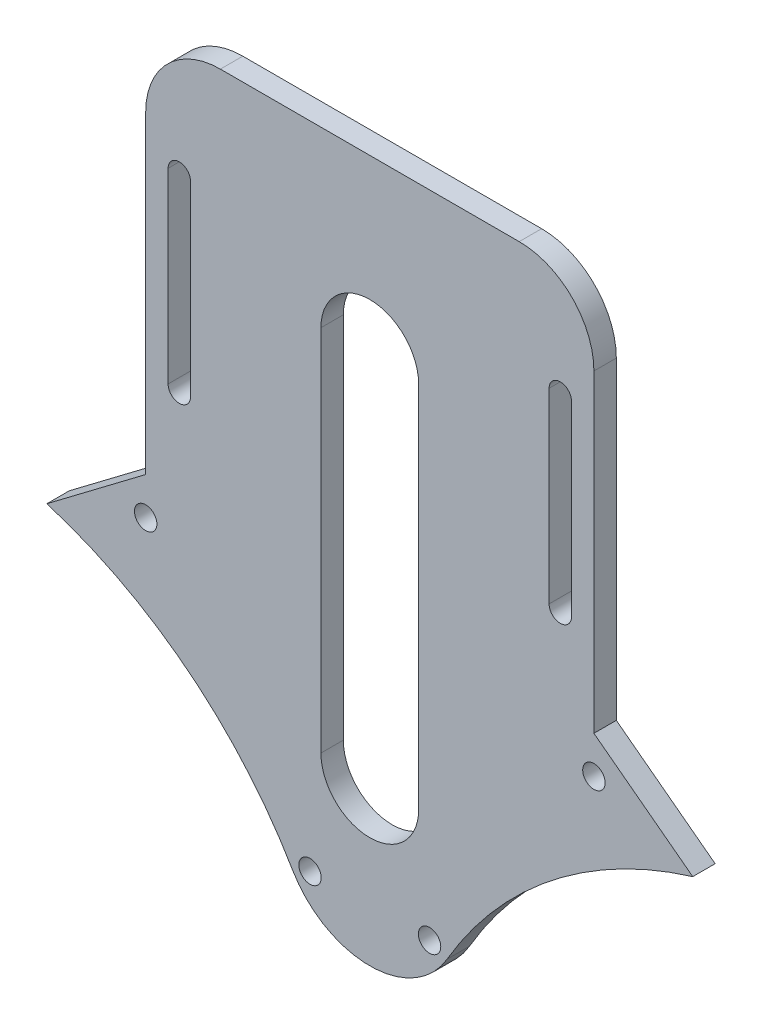
ISO-10303-21;
HEADER;
FILE_DESCRIPTION(('STEP AP214'),'2;1');
FILE_NAME('part.step','',(''),(''),'','','');
FILE_SCHEMA(('AUTOMOTIVE_DESIGN { 1 0 10303 214 1 1 1 1 }'));
ENDSEC;
DATA;
#1=APPLICATION_CONTEXT('core data for automotive mechanical design processes');
#2=APPLICATION_PROTOCOL_DEFINITION('international standard','automotive_design',2000,#1);
#3=PRODUCT_CONTEXT('',#1,'mechanical');
#4=PRODUCT('Part','Part','',(#3));
#5=PRODUCT_RELATED_PRODUCT_CATEGORY('part','',(#4));
#6=PRODUCT_DEFINITION_FORMATION('','',#4);
#7=PRODUCT_DEFINITION_CONTEXT('part definition',#1,'design');
#8=PRODUCT_DEFINITION('design','',#6,#7);
#9=PRODUCT_DEFINITION_SHAPE('','',#8);
#10=(LENGTH_UNIT() NAMED_UNIT(*) SI_UNIT(.MILLI.,.METRE.));
#11=(NAMED_UNIT(*) PLANE_ANGLE_UNIT() SI_UNIT($,.RADIAN.));
#12=(NAMED_UNIT(*) SI_UNIT($,.STERADIAN.) SOLID_ANGLE_UNIT());
#13=UNCERTAINTY_MEASURE_WITH_UNIT(LENGTH_MEASURE(1.E-05),#10,'distance_accuracy_value','');
#14=(GEOMETRIC_REPRESENTATION_CONTEXT(3) GLOBAL_UNCERTAINTY_ASSIGNED_CONTEXT((#13)) GLOBAL_UNIT_ASSIGNED_CONTEXT((#10,
#11,#12)) REPRESENTATION_CONTEXT('',''));
#15=CARTESIAN_POINT('',(0.,0.,0.));
#16=DIRECTION('',(0.,0.,1.));
#17=DIRECTION('',(1.,0.,0.));
#18=AXIS2_PLACEMENT_3D('',#15,#16,#17);
#19=CARTESIAN_POINT('',(-24.0000000000001,0.,3.));
#20=DIRECTION('',(1.,0.,0.));
#21=DIRECTION('',(0.,1.,0.));
#22=AXIS2_PLACEMENT_3D('',#19,#20,#21);
#23=PLANE('',#22);
#24=DIRECTION('',(0.,-1.,0.));
#25=VECTOR('',#24,1.);
#26=CARTESIAN_POINT('',(-24.0000000000001,0.,0.));
#27=LINE('',#26,#25);
#28=CARTESIAN_POINT('',(-23.9999999999998,102.,0.));
#29=VERTEX_POINT('',#28);
#30=CARTESIAN_POINT('',(-23.9999999999999,77.0000000000001,0.));
#31=VERTEX_POINT('',#30);
#32=EDGE_CURVE('E281',#29,#31,#27,.T.);
#33=ORIENTED_EDGE('',*,*,#32,.T.);
#34=DIRECTION('',(0.,0.,-1.));
#35=VECTOR('',#34,1.);
#36=CARTESIAN_POINT('',(-23.9999999999999,77.0000000000001,3.));
#37=LINE('',#36,#35);
#38=CARTESIAN_POINT('',(-23.9999999999999,77.0000000000001,3.));
#39=VERTEX_POINT('',#38);
#40=EDGE_CURVE('E11',#39,#31,#37,.T.);
#41=ORIENTED_EDGE('',*,*,#40,.F.);
#42=DIRECTION('',(0.,-1.,0.));
#43=VECTOR('',#42,1.);
#44=CARTESIAN_POINT('',(-24.0000000000001,0.,3.));
#45=LINE('',#44,#43);
#46=CARTESIAN_POINT('',(-23.9999999999998,102.,3.));
#47=VERTEX_POINT('',#46);
#48=EDGE_CURVE('E198',#47,#39,#45,.T.);
#49=ORIENTED_EDGE('',*,*,#48,.F.);
#50=DIRECTION('',(0.,0.,-1.));
#51=VECTOR('',#50,1.);
#52=CARTESIAN_POINT('',(-23.9999999999998,102.,3.));
#53=LINE('',#52,#51);
#54=EDGE_CURVE('E289',#47,#29,#53,.T.);
#55=ORIENTED_EDGE('',*,*,#54,.T.);
#56=EDGE_LOOP('',(#33,#41,#49,#55));
#57=FACE_BOUND('',#56,.T.);
#58=ADVANCED_FACE('F37',(#57),#23,.F.);
#59=CARTESIAN_POINT('',(-25.4999999999999,77.0000000000001,3.));
#60=DIRECTION('',(0.,0.,-1.));
#61=DIRECTION('',(-1.,0.,0.));
#62=AXIS2_PLACEMENT_3D('',#59,#60,#61);
#63=CYLINDRICAL_SURFACE('',#62,1.5);
#64=CARTESIAN_POINT('',(-25.4999999999999,77.0000000000001,0.));
#65=DIRECTION('',(0.,0.,1.));
#66=DIRECTION('',(1.,0.,0.));
#67=AXIS2_PLACEMENT_3D('',#64,#65,#66);
#68=CIRCLE('',#67,1.5);
#69=CARTESIAN_POINT('',(-26.9999999999999,77.0000000000001,0.));
#70=VERTEX_POINT('',#69);
#71=EDGE_CURVE('E204',#31,#70,#68,.F.);
#72=ORIENTED_EDGE('',*,*,#71,.T.);
#73=DIRECTION('',(0.,0.,-1.));
#74=VECTOR('',#73,1.);
#75=CARTESIAN_POINT('',(-26.9999999999999,77.0000000000001,3.));
#76=LINE('',#75,#74);
#77=CARTESIAN_POINT('',(-26.9999999999999,77.0000000000001,3.));
#78=VERTEX_POINT('',#77);
#79=EDGE_CURVE('E47',#78,#70,#76,.T.);
#80=ORIENTED_EDGE('',*,*,#79,.F.);
#81=CARTESIAN_POINT('',(-25.4999999999999,77.0000000000001,3.));
#82=DIRECTION('',(0.,0.,1.));
#83=DIRECTION('',(1.,0.,0.));
#84=AXIS2_PLACEMENT_3D('',#81,#82,#83);
#85=CIRCLE('',#84,1.5);
#86=EDGE_CURVE('E192',#39,#78,#85,.F.);
#87=ORIENTED_EDGE('',*,*,#86,.F.);
#88=ORIENTED_EDGE('',*,*,#40,.T.);
#89=EDGE_LOOP('',(#72,#80,#87,#88));
#90=FACE_BOUND('',#89,.T.);
#91=ADVANCED_FACE('F203',(#90),#63,.F.);
#92=CARTESIAN_POINT('',(-27.0000000000001,0.,3.));
#93=DIRECTION('',(1.,0.,0.));
#94=DIRECTION('',(0.,1.,0.));
#95=AXIS2_PLACEMENT_3D('',#92,#93,#94);
#96=PLANE('',#95);
#97=DIRECTION('',(0.,-1.,0.));
#98=VECTOR('',#97,1.);
#99=CARTESIAN_POINT('',(-27.0000000000001,0.,0.));
#100=LINE('',#99,#98);
#101=CARTESIAN_POINT('',(-26.9999999999998,102.,0.));
#102=VERTEX_POINT('',#101);
#103=EDGE_CURVE('E285',#102,#70,#100,.T.);
#104=ORIENTED_EDGE('',*,*,#103,.F.);
#105=DIRECTION('',(0.,0.,-1.));
#106=VECTOR('',#105,1.);
#107=CARTESIAN_POINT('',(-26.9999999999998,102.,3.));
#108=LINE('',#107,#106);
#109=CARTESIAN_POINT('',(-26.9999999999998,102.,3.));
#110=VERTEX_POINT('',#109);
#111=EDGE_CURVE('E126',#110,#102,#108,.T.);
#112=ORIENTED_EDGE('',*,*,#111,.F.);
#113=DIRECTION('',(0.,-1.,0.));
#114=VECTOR('',#113,1.);
#115=CARTESIAN_POINT('',(-27.0000000000001,0.,3.));
#116=LINE('',#115,#114);
#117=EDGE_CURVE('E196',#110,#78,#116,.T.);
#118=ORIENTED_EDGE('',*,*,#117,.T.);
#119=ORIENTED_EDGE('',*,*,#79,.T.);
#120=EDGE_LOOP('',(#104,#112,#118,#119));
#121=FACE_BOUND('',#120,.T.);
#122=ADVANCED_FACE('F209',(#121),#96,.T.);
#123=CARTESIAN_POINT('',(20.,107.,3.));
#124=DIRECTION('',(0.,0.,-1.));
#125=DIRECTION('',(-1.,0.,0.));
#126=AXIS2_PLACEMENT_3D('',#123,#124,#125);
#127=CYLINDRICAL_SURFACE('',#126,10.);
#128=CARTESIAN_POINT('',(20.,107.,0.));
#129=DIRECTION('',(0.,0.,1.));
#130=DIRECTION('',(1.,0.,0.));
#131=AXIS2_PLACEMENT_3D('',#128,#129,#130);
#132=CIRCLE('',#131,10.);
#133=CARTESIAN_POINT('',(19.9999999999999,117.,0.));
#134=VERTEX_POINT('',#133);
#135=CARTESIAN_POINT('',(30.,107.,0.));
#136=VERTEX_POINT('',#135);
#137=EDGE_CURVE('E251',#134,#136,#132,.F.);
#138=ORIENTED_EDGE('',*,*,#137,.F.);
#139=DIRECTION('',(0.,0.,-1.));
#140=VECTOR('',#139,1.);
#141=CARTESIAN_POINT('',(19.9999999999999,117.,3.));
#142=LINE('',#141,#140);
#143=CARTESIAN_POINT('',(19.9999999999999,117.,3.));
#144=VERTEX_POINT('',#143);
#145=EDGE_CURVE('E291',#144,#134,#142,.T.);
#146=ORIENTED_EDGE('',*,*,#145,.F.);
#147=CARTESIAN_POINT('',(20.,107.,3.));
#148=DIRECTION('',(0.,0.,1.));
#149=DIRECTION('',(1.,0.,0.));
#150=AXIS2_PLACEMENT_3D('',#147,#148,#149);
#151=CIRCLE('',#150,10.);
#152=CARTESIAN_POINT('',(30.,107.,3.));
#153=VERTEX_POINT('',#152);
#154=EDGE_CURVE('E367',#144,#153,#151,.F.);
#155=ORIENTED_EDGE('',*,*,#154,.T.);
#156=DIRECTION('',(0.,0.,-1.));
#157=VECTOR('',#156,1.);
#158=CARTESIAN_POINT('',(30.,107.,3.));
#159=LINE('',#158,#157);
#160=EDGE_CURVE('E293',#153,#136,#159,.T.);
#161=ORIENTED_EDGE('',*,*,#160,.T.);
#162=EDGE_LOOP('',(#138,#146,#155,#161));
#163=FACE_BOUND('',#162,.T.);
#164=ADVANCED_FACE('F404',(#163),#127,.T.);
#165=CARTESIAN_POINT('',(0.,117.,3.));
#166=DIRECTION('',(0.,-1.,0.));
#167=DIRECTION('',(0.,0.,-1.));
#168=AXIS2_PLACEMENT_3D('',#165,#166,#167);
#169=PLANE('',#168);
#170=DIRECTION('',(-1.,0.,0.));
#171=VECTOR('',#170,1.);
#172=CARTESIAN_POINT('',(0.,117.,0.));
#173=LINE('',#172,#171);
#174=CARTESIAN_POINT('',(-19.9999999999999,117.,0.));
#175=VERTEX_POINT('',#174);
#176=EDGE_CURVE('E254',#134,#175,#173,.T.);
#177=ORIENTED_EDGE('',*,*,#176,.T.);
#178=DIRECTION('',(0.,0.,-1.));
#179=VECTOR('',#178,1.);
#180=CARTESIAN_POINT('',(-19.9999999999999,117.,3.));
#181=LINE('',#180,#179);
#182=CARTESIAN_POINT('',(-19.9999999999999,117.,3.));
#183=VERTEX_POINT('',#182);
#184=EDGE_CURVE('E313',#183,#175,#181,.T.);
#185=ORIENTED_EDGE('',*,*,#184,.F.);
#186=DIRECTION('',(-1.,0.,0.));
#187=VECTOR('',#186,1.);
#188=CARTESIAN_POINT('',(0.,117.,3.));
#189=LINE('',#188,#187);
#190=EDGE_CURVE('E370',#144,#183,#189,.T.);
#191=ORIENTED_EDGE('',*,*,#190,.F.);
#192=ORIENTED_EDGE('',*,*,#145,.T.);
#193=EDGE_LOOP('',(#177,#185,#191,#192));
#194=FACE_BOUND('',#193,.T.);
#195=ADVANCED_FACE('F409',(#194),#169,.F.);
#196=CARTESIAN_POINT('',(-20.,107.,3.));
#197=DIRECTION('',(0.,0.,-1.));
#198=DIRECTION('',(-1.,0.,0.));
#199=AXIS2_PLACEMENT_3D('',#196,#197,#198);
#200=CYLINDRICAL_SURFACE('',#199,10.);
#201=CARTESIAN_POINT('',(-20.,107.,0.));
#202=DIRECTION('',(0.,0.,1.));
#203=DIRECTION('',(1.,0.,0.));
#204=AXIS2_PLACEMENT_3D('',#201,#202,#203);
#205=CIRCLE('',#204,10.);
#206=CARTESIAN_POINT('',(-30.,107.,0.));
#207=VERTEX_POINT('',#206);
#208=EDGE_CURVE('E257',#207,#175,#205,.F.);
#209=ORIENTED_EDGE('',*,*,#208,.F.);
#210=DIRECTION('',(0.,0.,-1.));
#211=VECTOR('',#210,1.);
#212=CARTESIAN_POINT('',(-30.,107.,3.));
#213=LINE('',#212,#211);
#214=CARTESIAN_POINT('',(-30.,107.,3.));
#215=VERTEX_POINT('',#214);
#216=EDGE_CURVE('E311',#215,#207,#213,.T.);
#217=ORIENTED_EDGE('',*,*,#216,.F.);
#218=CARTESIAN_POINT('',(-20.,107.,3.));
#219=DIRECTION('',(0.,0.,1.));
#220=DIRECTION('',(1.,0.,0.));
#221=AXIS2_PLACEMENT_3D('',#218,#219,#220);
#222=CIRCLE('',#221,10.);
#223=EDGE_CURVE('E372',#215,#183,#222,.F.);
#224=ORIENTED_EDGE('',*,*,#223,.T.);
#225=ORIENTED_EDGE('',*,*,#184,.T.);
#226=EDGE_LOOP('',(#209,#217,#224,#225));
#227=FACE_BOUND('',#226,.T.);
#228=ADVANCED_FACE('F415',(#227),#200,.T.);
#229=CARTESIAN_POINT('',(-30.,0.,3.));
#230=DIRECTION('',(1.,0.,0.));
#231=DIRECTION('',(0.,1.,0.));
#232=AXIS2_PLACEMENT_3D('',#229,#230,#231);
#233=PLANE('',#232);
#234=DIRECTION('',(0.,-1.,0.));
#235=VECTOR('',#234,1.);
#236=CARTESIAN_POINT('',(-30.,0.,0.));
#237=LINE('',#236,#235);
#238=CARTESIAN_POINT('',(-30.,65.,0.));
#239=VERTEX_POINT('',#238);
#240=EDGE_CURVE('E260',#207,#239,#237,.T.);
#241=ORIENTED_EDGE('',*,*,#240,.T.);
#242=DIRECTION('',(0.,0.,-1.));
#243=VECTOR('',#242,1.);
#244=CARTESIAN_POINT('',(-30.,65.,3.));
#245=LINE('',#244,#243);
#246=CARTESIAN_POINT('',(-30.,65.,3.));
#247=VERTEX_POINT('',#246);
#248=EDGE_CURVE('E308',#247,#239,#245,.T.);
#249=ORIENTED_EDGE('',*,*,#248,.F.);
#250=DIRECTION('',(0.,-1.,0.));
#251=VECTOR('',#250,1.);
#252=CARTESIAN_POINT('',(-30.,0.,3.));
#253=LINE('',#252,#251);
#254=EDGE_CURVE('E375',#215,#247,#253,.T.);
#255=ORIENTED_EDGE('',*,*,#254,.F.);
#256=ORIENTED_EDGE('',*,*,#216,.T.);
#257=EDGE_LOOP('',(#241,#249,#255,#256));
#258=FACE_BOUND('',#257,.T.);
#259=ADVANCED_FACE('F418',(#258),#233,.F.);
#260=CARTESIAN_POINT('',(-42.1758180792113,55.796457063803,3.));
#261=DIRECTION('',(0.603001408925935,-0.797740121112971,0.));
#262=DIRECTION('',(0.797740121112971,0.603001408925935,0.));
#263=AXIS2_PLACEMENT_3D('',#260,#261,#262);
#264=PLANE('',#263);
#265=DIRECTION('',(-0.797740121112971,-0.603001408925935,0.));
#266=VECTOR('',#265,1.);
#267=CARTESIAN_POINT('',(-42.1758180792113,55.796457063803,0.));
#268=LINE('',#267,#266);
#269=CARTESIAN_POINT('',(-43.2294901687526,55.0000000000001,0.));
#270=VERTEX_POINT('',#269);
#271=EDGE_CURVE('E263',#239,#270,#268,.T.);
#272=ORIENTED_EDGE('',*,*,#271,.T.);
#273=DIRECTION('',(0.,0.,-1.));
#274=VECTOR('',#273,1.);
#275=CARTESIAN_POINT('',(-43.2294901687526,55.0000000000001,3.));
#276=LINE('',#275,#274);
#277=CARTESIAN_POINT('',(-43.2294901687526,55.0000000000001,3.));
#278=VERTEX_POINT('',#277);
#279=EDGE_CURVE('E305',#278,#270,#276,.T.);
#280=ORIENTED_EDGE('',*,*,#279,.F.);
#281=DIRECTION('',(-0.797740121112971,-0.603001408925935,0.));
#282=VECTOR('',#281,1.);
#283=CARTESIAN_POINT('',(-42.1758180792113,55.796457063803,3.));
#284=LINE('',#283,#282);
#285=EDGE_CURVE('E378',#247,#278,#284,.T.);
#286=ORIENTED_EDGE('',*,*,#285,.F.);
#287=ORIENTED_EDGE('',*,*,#248,.T.);
#288=EDGE_LOOP('',(#272,#280,#286,#287));
#289=FACE_BOUND('',#288,.T.);
#290=ADVANCED_FACE('F420',(#289),#264,.F.);
#291=CARTESIAN_POINT('',(-60.,-2.38152510246026E-13,3.));
#292=DIRECTION('',(0.,0.,-1.));
#293=DIRECTION('',(-1.,0.,0.));
#294=AXIS2_PLACEMENT_3D('',#291,#292,#293);
#295=CYLINDRICAL_SURFACE('',#294,57.5000000000001);
#296=CARTESIAN_POINT('',(-60.,-2.38152510246026E-13,0.));
#297=DIRECTION('',(0.,0.,1.));
#298=DIRECTION('',(1.,0.,0.));
#299=AXIS2_PLACEMENT_3D('',#296,#297,#298);
#300=CIRCLE('',#299,57.5000000000001);
#301=CARTESIAN_POINT('',(-10.3327131983401,28.972583967635,0.));
#302=VERTEX_POINT('',#301);
#303=EDGE_CURVE('E266',#270,#302,#300,.F.);
#304=ORIENTED_EDGE('',*,*,#303,.T.);
#305=DIRECTION('',(0.,0.,-1.));
#306=VECTOR('',#305,1.);
#307=CARTESIAN_POINT('',(-10.3327131983401,28.972583967635,3.));
#308=LINE('',#307,#306);
#309=CARTESIAN_POINT('',(-10.3327131983401,28.972583967635,3.));
#310=VERTEX_POINT('',#309);
#311=EDGE_CURVE('E302',#310,#302,#308,.T.);
#312=ORIENTED_EDGE('',*,*,#311,.F.);
#313=CARTESIAN_POINT('',(-60.,-2.38152510246026E-13,3.));
#314=DIRECTION('',(0.,0.,1.));
#315=DIRECTION('',(1.,0.,0.));
#316=AXIS2_PLACEMENT_3D('',#313,#314,#315);
#317=CIRCLE('',#316,57.5000000000001);
#318=EDGE_CURVE('E381',#278,#310,#317,.F.);
#319=ORIENTED_EDGE('',*,*,#318,.F.);
#320=ORIENTED_EDGE('',*,*,#279,.T.);
#321=EDGE_LOOP('',(#304,#312,#319,#320));
#322=FACE_BOUND('',#321,.T.);
#323=ADVANCED_FACE('F425',(#322),#295,.F.);
#324=CARTESIAN_POINT('',(0.,35.,3.));
#325=DIRECTION('',(0.,0.,-1.));
#326=DIRECTION('',(-1.,0.,0.));
#327=AXIS2_PLACEMENT_3D('',#324,#325,#326);
#328=CYLINDRICAL_SURFACE('',#327,11.962219947249);
#329=CARTESIAN_POINT('',(0.,35.,0.));
#330=DIRECTION('',(0.,0.,1.));
#331=DIRECTION('',(1.,0.,0.));
#332=AXIS2_PLACEMENT_3D('',#329,#330,#331);
#333=CIRCLE('',#332,11.962219947249);
#334=CARTESIAN_POINT('',(10.33271319834,28.9725839676349,0.));
#335=VERTEX_POINT('',#334);
#336=EDGE_CURVE('E269',#302,#335,#333,.T.);
#337=ORIENTED_EDGE('',*,*,#336,.T.);
#338=DIRECTION('',(0.,0.,-1.));
#339=VECTOR('',#338,1.);
#340=CARTESIAN_POINT('',(10.33271319834,28.9725839676349,3.));
#341=LINE('',#340,#339);
#342=CARTESIAN_POINT('',(10.33271319834,28.9725839676349,3.));
#343=VERTEX_POINT('',#342);
#344=EDGE_CURVE('E300',#343,#335,#341,.T.);
#345=ORIENTED_EDGE('',*,*,#344,.F.);
#346=CARTESIAN_POINT('',(0.,35.,3.));
#347=DIRECTION('',(0.,0.,1.));
#348=DIRECTION('',(1.,0.,0.));
#349=AXIS2_PLACEMENT_3D('',#346,#347,#348);
#350=CIRCLE('',#349,11.962219947249);
#351=EDGE_CURVE('E384',#310,#343,#350,.T.);
#352=ORIENTED_EDGE('',*,*,#351,.F.);
#353=ORIENTED_EDGE('',*,*,#311,.T.);
#354=EDGE_LOOP('',(#337,#345,#352,#353));
#355=FACE_BOUND('',#354,.T.);
#356=ADVANCED_FACE('F427',(#355),#328,.T.);
#357=CARTESIAN_POINT('',(59.9999999999998,-4.18563751747614E-13,3.));
#358=DIRECTION('',(0.,0.,-1.));
#359=DIRECTION('',(-1.,0.,0.));
#360=AXIS2_PLACEMENT_3D('',#357,#358,#359);
#361=CYLINDRICAL_SURFACE('',#360,57.5000000000001);
#362=CARTESIAN_POINT('',(59.9999999999998,-4.18563751747614E-13,0.));
#363=DIRECTION('',(0.,0.,1.));
#364=DIRECTION('',(1.,0.,0.));
#365=AXIS2_PLACEMENT_3D('',#362,#363,#364);
#366=CIRCLE('',#365,57.5000000000001);
#367=CARTESIAN_POINT('',(43.2294901687526,55.,0.));
#368=VERTEX_POINT('',#367);
#369=EDGE_CURVE('E272',#368,#335,#366,.T.);
#370=ORIENTED_EDGE('',*,*,#369,.F.);
#371=DIRECTION('',(0.,0.,-1.));
#372=VECTOR('',#371,1.);
#373=CARTESIAN_POINT('',(43.2294901687526,55.,3.));
#374=LINE('',#373,#372);
#375=CARTESIAN_POINT('',(43.2294901687526,55.,3.));
#376=VERTEX_POINT('',#375);
#377=EDGE_CURVE('E298',#376,#368,#374,.T.);
#378=ORIENTED_EDGE('',*,*,#377,.F.);
#379=CARTESIAN_POINT('',(59.9999999999998,-4.18563751747614E-13,3.));
#380=DIRECTION('',(0.,0.,1.));
#381=DIRECTION('',(1.,0.,0.));
#382=AXIS2_PLACEMENT_3D('',#379,#380,#381);
#383=CIRCLE('',#382,57.5000000000001);
#384=EDGE_CURVE('E386',#376,#343,#383,.T.);
#385=ORIENTED_EDGE('',*,*,#384,.T.);
#386=ORIENTED_EDGE('',*,*,#344,.T.);
#387=EDGE_LOOP('',(#370,#378,#385,#386));
#388=FACE_BOUND('',#387,.T.);
#389=ADVANCED_FACE('F430',(#388),#361,.F.);
#390=CARTESIAN_POINT('',(42.1758180792115,55.7964570638027,3.));
#391=DIRECTION('',(0.603001408925939,0.797740121112968,0.));
#392=DIRECTION('',(-0.797740121112968,0.603001408925939,0.));
#393=AXIS2_PLACEMENT_3D('',#390,#391,#392);
#394=PLANE('',#393);
#395=DIRECTION('',(0.797740121112968,-0.603001408925939,0.));
#396=VECTOR('',#395,1.);
#397=CARTESIAN_POINT('',(42.1758180792115,55.7964570638027,0.));
#398=LINE('',#397,#396);
#399=CARTESIAN_POINT('',(30.,65.,0.));
#400=VERTEX_POINT('',#399);
#401=EDGE_CURVE('E275',#400,#368,#398,.T.);
#402=ORIENTED_EDGE('',*,*,#401,.F.);
#403=DIRECTION('',(0.,0.,-1.));
#404=VECTOR('',#403,1.);
#405=CARTESIAN_POINT('',(30.,65.,3.));
#406=LINE('',#405,#404);
#407=CARTESIAN_POINT('',(30.,65.,3.));
#408=VERTEX_POINT('',#407);
#409=EDGE_CURVE('E295',#408,#400,#406,.T.);
#410=ORIENTED_EDGE('',*,*,#409,.F.);
#411=DIRECTION('',(0.797740121112968,-0.603001408925939,0.));
#412=VECTOR('',#411,1.);
#413=CARTESIAN_POINT('',(42.1758180792115,55.7964570638027,3.));
#414=LINE('',#413,#412);
#415=EDGE_CURVE('E389',#408,#376,#414,.T.);
#416=ORIENTED_EDGE('',*,*,#415,.T.);
#417=ORIENTED_EDGE('',*,*,#377,.T.);
#418=EDGE_LOOP('',(#402,#410,#416,#417));
#419=FACE_BOUND('',#418,.T.);
#420=ADVANCED_FACE('F433',(#419),#394,.T.);
#421=CARTESIAN_POINT('',(25.5,77.,3.));
#422=DIRECTION('',(0.,0.,-1.));
#423=DIRECTION('',(-1.,0.,0.));
#424=AXIS2_PLACEMENT_3D('',#421,#422,#423);
#425=CYLINDRICAL_SURFACE('',#424,1.5);
#426=CARTESIAN_POINT('',(25.5,77.,0.));
#427=DIRECTION('',(0.,0.,1.));
#428=DIRECTION('',(1.,0.,0.));
#429=AXIS2_PLACEMENT_3D('',#426,#427,#428);
#430=CIRCLE('',#429,1.5);
#431=CARTESIAN_POINT('',(24.,77.,0.));
#432=VERTEX_POINT('',#431);
#433=CARTESIAN_POINT('',(27.,77.,0.));
#434=VERTEX_POINT('',#433);
#435=EDGE_CURVE('E239',#432,#434,#430,.T.);
#436=ORIENTED_EDGE('',*,*,#435,.F.);
#437=DIRECTION('',(0.,0.,-1.));
#438=VECTOR('',#437,1.);
#439=CARTESIAN_POINT('',(24.,77.,3.));
#440=LINE('',#439,#438);
#441=CARTESIAN_POINT('',(24.,77.,3.));
#442=VERTEX_POINT('',#441);
#443=EDGE_CURVE('E296',#442,#432,#440,.T.);
#444=ORIENTED_EDGE('',*,*,#443,.F.);
#445=CARTESIAN_POINT('',(25.5,77.,3.));
#446=DIRECTION('',(0.,0.,1.));
#447=DIRECTION('',(1.,0.,0.));
#448=AXIS2_PLACEMENT_3D('',#445,#446,#447);
#449=CIRCLE('',#448,1.5);
#450=CARTESIAN_POINT('',(27.,77.,3.));
#451=VERTEX_POINT('',#450);
#452=EDGE_CURVE('E349',#442,#451,#449,.T.);
#453=ORIENTED_EDGE('',*,*,#452,.T.);
#454=DIRECTION('',(0.,0.,-1.));
#455=VECTOR('',#454,1.);
#456=CARTESIAN_POINT('',(27.,77.,3.));
#457=LINE('',#456,#455);
#458=EDGE_CURVE('E316',#451,#434,#457,.T.);
#459=ORIENTED_EDGE('',*,*,#458,.T.);
#460=EDGE_LOOP('',(#436,#444,#453,#459));
#461=FACE_BOUND('',#460,.T.);
#462=ADVANCED_FACE('F465',(#461),#425,.F.);
#463=CARTESIAN_POINT('',(24.,0.,3.));
#464=DIRECTION('',(1.,0.,0.));
#465=DIRECTION('',(0.,1.,0.));
#466=AXIS2_PLACEMENT_3D('',#463,#464,#465);
#467=PLANE('',#466);
#468=DIRECTION('',(0.,-1.,0.));
#469=VECTOR('',#468,1.);
#470=CARTESIAN_POINT('',(24.,0.,0.));
#471=LINE('',#470,#469);
#472=CARTESIAN_POINT('',(24.,102.,0.));
#473=VERTEX_POINT('',#472);
#474=EDGE_CURVE('E242',#473,#432,#471,.T.);
#475=ORIENTED_EDGE('',*,*,#474,.F.);
#476=DIRECTION('',(0.,0.,-1.));
#477=VECTOR('',#476,1.);
#478=CARTESIAN_POINT('',(24.,102.,3.));
#479=LINE('',#478,#477);
#480=CARTESIAN_POINT('',(24.,102.,3.));
#481=VERTEX_POINT('',#480);
#482=EDGE_CURVE('E320',#481,#473,#479,.T.);
#483=ORIENTED_EDGE('',*,*,#482,.F.);
#484=DIRECTION('',(0.,-1.,0.));
#485=VECTOR('',#484,1.);
#486=CARTESIAN_POINT('',(24.,0.,3.));
#487=LINE('',#486,#485);
#488=EDGE_CURVE('E359',#481,#442,#487,.T.);
#489=ORIENTED_EDGE('',*,*,#488,.T.);
#490=ORIENTED_EDGE('',*,*,#443,.T.);
#491=EDGE_LOOP('',(#475,#483,#489,#490));
#492=FACE_BOUND('',#491,.T.);
#493=ADVANCED_FACE('F488',(#492),#467,.T.);
#494=CARTESIAN_POINT('',(25.5,102.,3.));
#495=DIRECTION('',(0.,0.,-1.));
#496=DIRECTION('',(-1.,0.,0.));
#497=AXIS2_PLACEMENT_3D('',#494,#495,#496);
#498=CYLINDRICAL_SURFACE('',#497,1.5);
#499=CARTESIAN_POINT('',(25.5,102.,0.));
#500=DIRECTION('',(0.,0.,1.));
#501=DIRECTION('',(1.,0.,0.));
#502=AXIS2_PLACEMENT_3D('',#499,#500,#501);
#503=CIRCLE('',#502,1.5);
#504=CARTESIAN_POINT('',(27.,102.,0.));
#505=VERTEX_POINT('',#504);
#506=EDGE_CURVE('E245',#505,#473,#503,.T.);
#507=ORIENTED_EDGE('',*,*,#506,.F.);
#508=DIRECTION('',(0.,0.,-1.));
#509=VECTOR('',#508,1.);
#510=CARTESIAN_POINT('',(27.,102.,3.));
#511=LINE('',#510,#509);
#512=CARTESIAN_POINT('',(27.,102.,3.));
#513=VERTEX_POINT('',#512);
#514=EDGE_CURVE('E318',#513,#505,#511,.T.);
#515=ORIENTED_EDGE('',*,*,#514,.F.);
#516=CARTESIAN_POINT('',(25.5,102.,3.));
#517=DIRECTION('',(0.,0.,1.));
#518=DIRECTION('',(1.,0.,0.));
#519=AXIS2_PLACEMENT_3D('',#516,#517,#518);
#520=CIRCLE('',#519,1.5);
#521=EDGE_CURVE('E362',#513,#481,#520,.T.);
#522=ORIENTED_EDGE('',*,*,#521,.T.);
#523=ORIENTED_EDGE('',*,*,#482,.T.);
#524=EDGE_LOOP('',(#507,#515,#522,#523));
#525=FACE_BOUND('',#524,.T.);
#526=ADVANCED_FACE('F485',(#525),#498,.F.);
#527=CARTESIAN_POINT('',(0.,93.7489491860057,3.));
#528=DIRECTION('',(0.,0.,-1.));
#529=DIRECTION('',(-1.,0.,0.));
#530=AXIS2_PLACEMENT_3D('',#527,#528,#529);
#531=CYLINDRICAL_SURFACE('',#530,6.54179371023542);
#532=CARTESIAN_POINT('',(0.,93.7489491860057,0.));
#533=DIRECTION('',(0.,0.,1.));
#534=DIRECTION('',(1.,0.,0.));
#535=AXIS2_PLACEMENT_3D('',#532,#533,#534);
#536=CIRCLE('',#535,6.54179371023542);
#537=CARTESIAN_POINT('',(6.54179371023542,93.7489491860057,0.));
#538=VERTEX_POINT('',#537);
#539=CARTESIAN_POINT('',(-6.54179371023542,93.7489491860057,0.));
#540=VERTEX_POINT('',#539);
#541=EDGE_CURVE('E227',#538,#540,#536,.T.);
#542=ORIENTED_EDGE('',*,*,#541,.F.);
#543=DIRECTION('',(0.,0.,-1.));
#544=VECTOR('',#543,1.);
#545=CARTESIAN_POINT('',(6.54179371023542,93.7489491860057,3.));
#546=LINE('',#545,#544);
#547=CARTESIAN_POINT('',(6.54179371023542,93.7489491860057,3.));
#548=VERTEX_POINT('',#547);
#549=EDGE_CURVE('E41',#548,#538,#546,.T.);
#550=ORIENTED_EDGE('',*,*,#549,.F.);
#551=CARTESIAN_POINT('',(0.,93.7489491860057,3.));
#552=DIRECTION('',(0.,0.,1.));
#553=DIRECTION('',(1.,0.,0.));
#554=AXIS2_PLACEMENT_3D('',#551,#552,#553);
#555=CIRCLE('',#554,6.54179371023542);
#556=CARTESIAN_POINT('',(-6.54179371023542,93.7489491860057,3.));
#557=VERTEX_POINT('',#556);
#558=EDGE_CURVE('E353',#548,#557,#555,.T.);
#559=ORIENTED_EDGE('',*,*,#558,.T.);
#560=DIRECTION('',(0.,0.,-1.));
#561=VECTOR('',#560,1.);
#562=CARTESIAN_POINT('',(-6.54179371023542,93.7489491860057,3.));
#563=LINE('',#562,#561);
#564=EDGE_CURVE('E211',#557,#540,#563,.T.);
#565=ORIENTED_EDGE('',*,*,#564,.T.);
#566=EDGE_LOOP('',(#542,#550,#559,#565));
#567=FACE_BOUND('',#566,.T.);
#568=ADVANCED_FACE('F335',(#567),#531,.F.);
#569=CARTESIAN_POINT('',(6.54179371023542,0.,3.));
#570=DIRECTION('',(-1.,0.,0.));
#571=DIRECTION('',(0.,0.,1.));
#572=AXIS2_PLACEMENT_3D('',#569,#570,#571);
#573=PLANE('',#572);
#574=DIRECTION('',(0.,1.,0.));
#575=VECTOR('',#574,1.);
#576=CARTESIAN_POINT('',(6.54179371023542,0.,0.));
#577=LINE('',#576,#575);
#578=CARTESIAN_POINT('',(6.54179371023542,44.4384306270993,0.));
#579=VERTEX_POINT('',#578);
#580=EDGE_CURVE('E230',#579,#538,#577,.T.);
#581=ORIENTED_EDGE('',*,*,#580,.F.);
#582=DIRECTION('',(0.,0.,-1.));
#583=VECTOR('',#582,1.);
#584=CARTESIAN_POINT('',(6.54179371023542,44.4384306270993,3.));
#585=LINE('',#584,#583);
#586=CARTESIAN_POINT('',(6.54179371023542,44.4384306270993,3.));
#587=VERTEX_POINT('',#586);
#588=EDGE_CURVE('E325',#587,#579,#585,.T.);
#589=ORIENTED_EDGE('',*,*,#588,.F.);
#590=DIRECTION('',(0.,1.,0.));
#591=VECTOR('',#590,1.);
#592=CARTESIAN_POINT('',(6.54179371023542,0.,3.));
#593=LINE('',#592,#591);
#594=EDGE_CURVE('E334',#587,#548,#593,.T.);
#595=ORIENTED_EDGE('',*,*,#594,.T.);
#596=ORIENTED_EDGE('',*,*,#549,.T.);
#597=EDGE_LOOP('',(#581,#589,#595,#596));
#598=FACE_BOUND('',#597,.T.);
#599=ADVANCED_FACE('F332',(#598),#573,.T.);
#600=CARTESIAN_POINT('',(0.,44.4384306270993,3.));
#601=DIRECTION('',(0.,0.,-1.));
#602=DIRECTION('',(-1.,0.,0.));
#603=AXIS2_PLACEMENT_3D('',#600,#601,#602);
#604=CYLINDRICAL_SURFACE('',#603,6.54179371023542);
#605=CARTESIAN_POINT('',(0.,44.4384306270993,0.));
#606=DIRECTION('',(0.,0.,1.));
#607=DIRECTION('',(1.,0.,0.));
#608=AXIS2_PLACEMENT_3D('',#605,#606,#607);
#609=CIRCLE('',#608,6.54179371023542);
#610=CARTESIAN_POINT('',(-6.54179371023542,44.4384306270993,0.));
#611=VERTEX_POINT('',#610);
#612=EDGE_CURVE('E233',#611,#579,#609,.T.);
#613=ORIENTED_EDGE('',*,*,#612,.F.);
#614=DIRECTION('',(0.,0.,-1.));
#615=VECTOR('',#614,1.);
#616=CARTESIAN_POINT('',(-6.54179371023542,44.4384306270993,3.));
#617=LINE('',#616,#615);
#618=CARTESIAN_POINT('',(-6.54179371023542,44.4384306270993,3.));
#619=VERTEX_POINT('',#618);
#620=EDGE_CURVE('E324',#619,#611,#617,.T.);
#621=ORIENTED_EDGE('',*,*,#620,.F.);
#622=CARTESIAN_POINT('',(0.,44.4384306270993,3.));
#623=DIRECTION('',(0.,0.,1.));
#624=DIRECTION('',(1.,0.,0.));
#625=AXIS2_PLACEMENT_3D('',#622,#623,#624);
#626=CIRCLE('',#625,6.54179371023542);
#627=EDGE_CURVE('E344',#619,#587,#626,.T.);
#628=ORIENTED_EDGE('',*,*,#627,.T.);
#629=ORIENTED_EDGE('',*,*,#588,.T.);
#630=EDGE_LOOP('',(#613,#621,#628,#629));
#631=FACE_BOUND('',#630,.T.);
#632=ADVANCED_FACE('F341',(#631),#604,.F.);
#633=CARTESIAN_POINT('',(30.,0.,3.));
#634=DIRECTION('',(-1.,0.,0.));
#635=DIRECTION('',(0.,-1.,0.));
#636=AXIS2_PLACEMENT_3D('',#633,#634,#635);
#637=PLANE('',#636);
#638=DIRECTION('',(0.,1.,0.));
#639=VECTOR('',#638,1.);
#640=CARTESIAN_POINT('',(30.,0.,0.));
#641=LINE('',#640,#639);
#642=EDGE_CURVE('E278',#400,#136,#641,.T.);
#643=ORIENTED_EDGE('',*,*,#642,.T.);
#644=ORIENTED_EDGE('',*,*,#160,.F.);
#645=DIRECTION('',(0.,1.,0.));
#646=VECTOR('',#645,1.);
#647=CARTESIAN_POINT('',(30.,0.,3.));
#648=LINE('',#647,#646);
#649=EDGE_CURVE('E392',#408,#153,#648,.T.);
#650=ORIENTED_EDGE('',*,*,#649,.F.);
#651=ORIENTED_EDGE('',*,*,#409,.T.);
#652=EDGE_LOOP('',(#643,#644,#650,#651));
#653=FACE_BOUND('',#652,.T.);
#654=ADVANCED_FACE('F400',(#653),#637,.F.);
#655=CARTESIAN_POINT('',(27.,0.,3.));
#656=DIRECTION('',(1.,0.,0.));
#657=DIRECTION('',(0.,0.,-1.));
#658=AXIS2_PLACEMENT_3D('',#655,#656,#657);
#659=PLANE('',#658);
#660=DIRECTION('',(0.,-1.,0.));
#661=VECTOR('',#660,1.);
#662=CARTESIAN_POINT('',(27.,0.,0.));
#663=LINE('',#662,#661);
#664=EDGE_CURVE('E248',#505,#434,#663,.T.);
#665=ORIENTED_EDGE('',*,*,#664,.T.);
#666=ORIENTED_EDGE('',*,*,#458,.F.);
#667=DIRECTION('',(0.,-1.,0.));
#668=VECTOR('',#667,1.);
#669=CARTESIAN_POINT('',(27.,0.,3.));
#670=LINE('',#669,#668);
#671=EDGE_CURVE('E365',#513,#451,#670,.T.);
#672=ORIENTED_EDGE('',*,*,#671,.F.);
#673=ORIENTED_EDGE('',*,*,#514,.T.);
#674=EDGE_LOOP('',(#665,#666,#672,#673));
#675=FACE_BOUND('',#674,.T.);
#676=ADVANCED_FACE('F462',(#675),#659,.F.);
#677=CARTESIAN_POINT('',(-6.54179371023542,0.,3.));
#678=DIRECTION('',(-1.,0.,0.));
#679=DIRECTION('',(0.,0.,1.));
#680=AXIS2_PLACEMENT_3D('',#677,#678,#679);
#681=PLANE('',#680);
#682=DIRECTION('',(0.,1.,0.));
#683=VECTOR('',#682,1.);
#684=CARTESIAN_POINT('',(-6.54179371023542,0.,0.));
#685=LINE('',#684,#683);
#686=EDGE_CURVE('E236',#611,#540,#685,.T.);
#687=ORIENTED_EDGE('',*,*,#686,.T.);
#688=ORIENTED_EDGE('',*,*,#564,.F.);
#689=DIRECTION('',(0.,1.,0.));
#690=VECTOR('',#689,1.);
#691=CARTESIAN_POINT('',(-6.54179371023542,0.,3.));
#692=LINE('',#691,#690);
#693=EDGE_CURVE('E346',#619,#557,#692,.T.);
#694=ORIENTED_EDGE('',*,*,#693,.F.);
#695=ORIENTED_EDGE('',*,*,#620,.T.);
#696=EDGE_LOOP('',(#687,#688,#694,#695));
#697=FACE_BOUND('',#696,.T.);
#698=ADVANCED_FACE('F347',(#697),#681,.F.);
#699=CARTESIAN_POINT('',(-30.,60.,3.));
#700=DIRECTION('',(0.,0.,-1.));
#701=DIRECTION('',(-1.,0.,0.));
#702=AXIS2_PLACEMENT_3D('',#699,#700,#701);
#703=CYLINDRICAL_SURFACE('',#702,1.5);
#704=CARTESIAN_POINT('',(-30.,60.,3.));
#705=DIRECTION('',(0.,0.,1.));
#706=DIRECTION('',(1.,0.,0.));
#707=AXIS2_PLACEMENT_3D('',#704,#705,#706);
#708=CIRCLE('',#707,1.5);
#709=CARTESIAN_POINT('',(-28.5,60.,3.));
#710=VERTEX_POINT('',#709);
#711=EDGE_CURVE('E531',#710,#710,#708,.T.);
#712=ORIENTED_EDGE('',*,*,#711,.T.);
#713=EDGE_LOOP('',(#712));
#714=FACE_BOUND('',#713,.T.);
#715=CARTESIAN_POINT('',(-30.,60.,0.));
#716=DIRECTION('',(0.,0.,1.));
#717=DIRECTION('',(1.,0.,0.));
#718=AXIS2_PLACEMENT_3D('',#715,#716,#717);
#719=CIRCLE('',#718,1.5);
#720=CARTESIAN_POINT('',(-28.5,60.,0.));
#721=VERTEX_POINT('',#720);
#722=EDGE_CURVE('E224',#721,#721,#719,.T.);
#723=ORIENTED_EDGE('',*,*,#722,.F.);
#724=EDGE_LOOP('',(#723));
#725=FACE_BOUND('',#724,.T.);
#726=ADVANCED_FACE('F498',(#714,#725),#703,.F.);
#727=CARTESIAN_POINT('',(-8.00000000000001,30.,3.));
#728=DIRECTION('',(0.,0.,-1.));
#729=DIRECTION('',(-1.,0.,0.));
#730=AXIS2_PLACEMENT_3D('',#727,#728,#729);
#731=CYLINDRICAL_SURFACE('',#730,1.5);
#732=CARTESIAN_POINT('',(-8.00000000000001,30.,3.));
#733=DIRECTION('',(0.,0.,1.));
#734=DIRECTION('',(1.,0.,0.));
#735=AXIS2_PLACEMENT_3D('',#732,#733,#734);
#736=CIRCLE('',#735,1.5);
#737=CARTESIAN_POINT('',(-6.50000000000001,30.,3.));
#738=VERTEX_POINT('',#737);
#739=EDGE_CURVE('E528',#738,#738,#736,.T.);
#740=ORIENTED_EDGE('',*,*,#739,.T.);
#741=EDGE_LOOP('',(#740));
#742=FACE_BOUND('',#741,.T.);
#743=CARTESIAN_POINT('',(-8.00000000000001,30.,0.));
#744=DIRECTION('',(0.,0.,1.));
#745=DIRECTION('',(1.,0.,0.));
#746=AXIS2_PLACEMENT_3D('',#743,#744,#745);
#747=CIRCLE('',#746,1.5);
#748=CARTESIAN_POINT('',(-6.50000000000001,30.,0.));
#749=VERTEX_POINT('',#748);
#750=EDGE_CURVE('E221',#749,#749,#747,.T.);
#751=ORIENTED_EDGE('',*,*,#750,.F.);
#752=EDGE_LOOP('',(#751));
#753=FACE_BOUND('',#752,.T.);
#754=ADVANCED_FACE('F507',(#742,#753),#731,.F.);
#755=CARTESIAN_POINT('',(7.99999999999999,30.,3.));
#756=DIRECTION('',(0.,0.,-1.));
#757=DIRECTION('',(-1.,0.,0.));
#758=AXIS2_PLACEMENT_3D('',#755,#756,#757);
#759=CYLINDRICAL_SURFACE('',#758,1.5);
#760=CARTESIAN_POINT('',(7.99999999999999,30.,3.));
#761=DIRECTION('',(0.,0.,1.));
#762=DIRECTION('',(1.,0.,0.));
#763=AXIS2_PLACEMENT_3D('',#760,#761,#762);
#764=CIRCLE('',#763,1.5);
#765=CARTESIAN_POINT('',(9.49999999999999,30.,3.));
#766=VERTEX_POINT('',#765);
#767=EDGE_CURVE('E518',#766,#766,#764,.T.);
#768=ORIENTED_EDGE('',*,*,#767,.T.);
#769=EDGE_LOOP('',(#768));
#770=FACE_BOUND('',#769,.T.);
#771=CARTESIAN_POINT('',(7.99999999999999,30.,0.));
#772=DIRECTION('',(0.,0.,1.));
#773=DIRECTION('',(1.,0.,0.));
#774=AXIS2_PLACEMENT_3D('',#771,#772,#773);
#775=CIRCLE('',#774,1.5);
#776=CARTESIAN_POINT('',(9.49999999999999,30.,0.));
#777=VERTEX_POINT('',#776);
#778=EDGE_CURVE('E218',#777,#777,#775,.T.);
#779=ORIENTED_EDGE('',*,*,#778,.F.);
#780=EDGE_LOOP('',(#779));
#781=FACE_BOUND('',#780,.T.);
#782=ADVANCED_FACE('F450',(#770,#781),#759,.F.);
#783=CARTESIAN_POINT('',(30.,60.,3.));
#784=DIRECTION('',(0.,0.,-1.));
#785=DIRECTION('',(-1.,0.,0.));
#786=AXIS2_PLACEMENT_3D('',#783,#784,#785);
#787=CYLINDRICAL_SURFACE('',#786,1.5);
#788=CARTESIAN_POINT('',(30.,60.,3.));
#789=DIRECTION('',(0.,0.,1.));
#790=DIRECTION('',(1.,0.,0.));
#791=AXIS2_PLACEMENT_3D('',#788,#789,#790);
#792=CIRCLE('',#791,1.5);
#793=CARTESIAN_POINT('',(31.5,60.,3.));
#794=VERTEX_POINT('',#793);
#795=EDGE_CURVE('E288',#794,#794,#792,.T.);
#796=ORIENTED_EDGE('',*,*,#795,.T.);
#797=EDGE_LOOP('',(#796));
#798=FACE_BOUND('',#797,.T.);
#799=CARTESIAN_POINT('',(30.,60.,0.));
#800=DIRECTION('',(0.,0.,1.));
#801=DIRECTION('',(1.,0.,0.));
#802=AXIS2_PLACEMENT_3D('',#799,#800,#801);
#803=CIRCLE('',#802,1.5);
#804=CARTESIAN_POINT('',(31.5,60.,0.));
#805=VERTEX_POINT('',#804);
#806=EDGE_CURVE('E215',#805,#805,#803,.T.);
#807=ORIENTED_EDGE('',*,*,#806,.F.);
#808=EDGE_LOOP('',(#807));
#809=FACE_BOUND('',#808,.T.);
#810=ADVANCED_FACE('F39',(#798,#809),#787,.F.);
#811=CARTESIAN_POINT('',(-25.4999999999998,102.,3.));
#812=DIRECTION('',(0.,0.,-1.));
#813=DIRECTION('',(-1.,0.,0.));
#814=AXIS2_PLACEMENT_3D('',#811,#812,#813);
#815=CYLINDRICAL_SURFACE('',#814,1.5);
#816=CARTESIAN_POINT('',(-25.4999999999998,102.,0.));
#817=DIRECTION('',(0.,0.,1.));
#818=DIRECTION('',(1.,0.,0.));
#819=AXIS2_PLACEMENT_3D('',#816,#817,#818);
#820=CIRCLE('',#819,1.5);
#821=EDGE_CURVE('E129',#102,#29,#820,.F.);
#822=ORIENTED_EDGE('',*,*,#821,.T.);
#823=ORIENTED_EDGE('',*,*,#54,.F.);
#824=CARTESIAN_POINT('',(-25.4999999999998,102.,3.));
#825=DIRECTION('',(0.,0.,1.));
#826=DIRECTION('',(1.,0.,0.));
#827=AXIS2_PLACEMENT_3D('',#824,#825,#826);
#828=CIRCLE('',#827,1.5);
#829=EDGE_CURVE('E56',#110,#47,#828,.F.);
#830=ORIENTED_EDGE('',*,*,#829,.F.);
#831=ORIENTED_EDGE('',*,*,#111,.T.);
#832=EDGE_LOOP('',(#822,#823,#830,#831));
#833=FACE_BOUND('',#832,.T.);
#834=ADVANCED_FACE('F441',(#833),#815,.F.);
#835=CARTESIAN_POINT('',(0.,0.,3.));
#836=DIRECTION('',(0.,0.,1.));
#837=DIRECTION('',(1.,0.,0.));
#838=AXIS2_PLACEMENT_3D('',#835,#836,#837);
#839=PLANE('',#838);
#840=ORIENTED_EDGE('',*,*,#795,.F.);
#841=EDGE_LOOP('',(#840));
#842=FACE_BOUND('',#841,.T.);
#843=ORIENTED_EDGE('',*,*,#767,.F.);
#844=EDGE_LOOP('',(#843));
#845=FACE_BOUND('',#844,.T.);
#846=ORIENTED_EDGE('',*,*,#739,.F.);
#847=EDGE_LOOP('',(#846));
#848=FACE_BOUND('',#847,.T.);
#849=ORIENTED_EDGE('',*,*,#711,.F.);
#850=EDGE_LOOP('',(#849));
#851=FACE_BOUND('',#850,.T.);
#852=ORIENTED_EDGE('',*,*,#558,.F.);
#853=ORIENTED_EDGE('',*,*,#594,.F.);
#854=ORIENTED_EDGE('',*,*,#627,.F.);
#855=ORIENTED_EDGE('',*,*,#693,.T.);
#856=EDGE_LOOP('',(#852,#853,#854,#855));
#857=FACE_BOUND('',#856,.T.);
#858=ORIENTED_EDGE('',*,*,#452,.F.);
#859=ORIENTED_EDGE('',*,*,#488,.F.);
#860=ORIENTED_EDGE('',*,*,#521,.F.);
#861=ORIENTED_EDGE('',*,*,#671,.T.);
#862=EDGE_LOOP('',(#858,#859,#860,#861));
#863=FACE_BOUND('',#862,.T.);
#864=ORIENTED_EDGE('',*,*,#154,.F.);
#865=ORIENTED_EDGE('',*,*,#190,.T.);
#866=ORIENTED_EDGE('',*,*,#223,.F.);
#867=ORIENTED_EDGE('',*,*,#254,.T.);
#868=ORIENTED_EDGE('',*,*,#285,.T.);
#869=ORIENTED_EDGE('',*,*,#318,.T.);
#870=ORIENTED_EDGE('',*,*,#351,.T.);
#871=ORIENTED_EDGE('',*,*,#384,.F.);
#872=ORIENTED_EDGE('',*,*,#415,.F.);
#873=ORIENTED_EDGE('',*,*,#649,.T.);
#874=EDGE_LOOP('',(#864,#865,#866,#867,#868,#869,#870,#871,#872,#873));
#875=FACE_BOUND('',#874,.T.);
#876=ORIENTED_EDGE('',*,*,#48,.T.);
#877=ORIENTED_EDGE('',*,*,#86,.T.);
#878=ORIENTED_EDGE('',*,*,#117,.F.);
#879=ORIENTED_EDGE('',*,*,#829,.T.);
#880=EDGE_LOOP('',(#876,#877,#878,#879));
#881=FACE_BOUND('',#880,.T.);
#882=ADVANCED_FACE('F194',(#842,#845,#848,#851,#857,#863,#875,#881),#839,.T.);
#883=CARTESIAN_POINT('',(0.,0.,0.));
#884=DIRECTION('',(0.,0.,1.));
#885=DIRECTION('',(1.,0.,0.));
#886=AXIS2_PLACEMENT_3D('',#883,#884,#885);
#887=PLANE('',#886);
#888=ORIENTED_EDGE('',*,*,#806,.T.);
#889=EDGE_LOOP('',(#888));
#890=FACE_BOUND('',#889,.T.);
#891=ORIENTED_EDGE('',*,*,#778,.T.);
#892=EDGE_LOOP('',(#891));
#893=FACE_BOUND('',#892,.T.);
#894=ORIENTED_EDGE('',*,*,#750,.T.);
#895=EDGE_LOOP('',(#894));
#896=FACE_BOUND('',#895,.T.);
#897=ORIENTED_EDGE('',*,*,#722,.T.);
#898=EDGE_LOOP('',(#897));
#899=FACE_BOUND('',#898,.T.);
#900=ORIENTED_EDGE('',*,*,#541,.T.);
#901=ORIENTED_EDGE('',*,*,#686,.F.);
#902=ORIENTED_EDGE('',*,*,#612,.T.);
#903=ORIENTED_EDGE('',*,*,#580,.T.);
#904=EDGE_LOOP('',(#900,#901,#902,#903));
#905=FACE_BOUND('',#904,.T.);
#906=ORIENTED_EDGE('',*,*,#435,.T.);
#907=ORIENTED_EDGE('',*,*,#664,.F.);
#908=ORIENTED_EDGE('',*,*,#506,.T.);
#909=ORIENTED_EDGE('',*,*,#474,.T.);
#910=EDGE_LOOP('',(#906,#907,#908,#909));
#911=FACE_BOUND('',#910,.T.);
#912=ORIENTED_EDGE('',*,*,#137,.T.);
#913=ORIENTED_EDGE('',*,*,#642,.F.);
#914=ORIENTED_EDGE('',*,*,#401,.T.);
#915=ORIENTED_EDGE('',*,*,#369,.T.);
#916=ORIENTED_EDGE('',*,*,#336,.F.);
#917=ORIENTED_EDGE('',*,*,#303,.F.);
#918=ORIENTED_EDGE('',*,*,#271,.F.);
#919=ORIENTED_EDGE('',*,*,#240,.F.);
#920=ORIENTED_EDGE('',*,*,#208,.T.);
#921=ORIENTED_EDGE('',*,*,#176,.F.);
#922=EDGE_LOOP('',(#912,#913,#914,#915,#916,#917,#918,#919,#920,#921));
#923=FACE_BOUND('',#922,.T.);
#924=ORIENTED_EDGE('',*,*,#32,.F.);
#925=ORIENTED_EDGE('',*,*,#821,.F.);
#926=ORIENTED_EDGE('',*,*,#103,.T.);
#927=ORIENTED_EDGE('',*,*,#71,.F.);
#928=EDGE_LOOP('',(#924,#925,#926,#927));
#929=FACE_BOUND('',#928,.T.);
#930=ADVANCED_FACE('F339',(#890,#893,#896,#899,#905,#911,#923,#929),#887,.F.);
#931=CLOSED_SHELL('',(#58,#91,#122,#164,#195,#228,#259,#290,#323,#356,#389,#420,#462,#493,#526,
#568,#599,#632,#654,#676,#698,#726,#754,#782,#810,#834,#882,#930));
#932=MANIFOLD_SOLID_BREP('B2',#931);
#933=ADVANCED_BREP_SHAPE_REPRESENTATION('',(#18,#932),#14);
#934=SHAPE_DEFINITION_REPRESENTATION(#9,#933);
ENDSEC;
END-ISO-10303-21;
